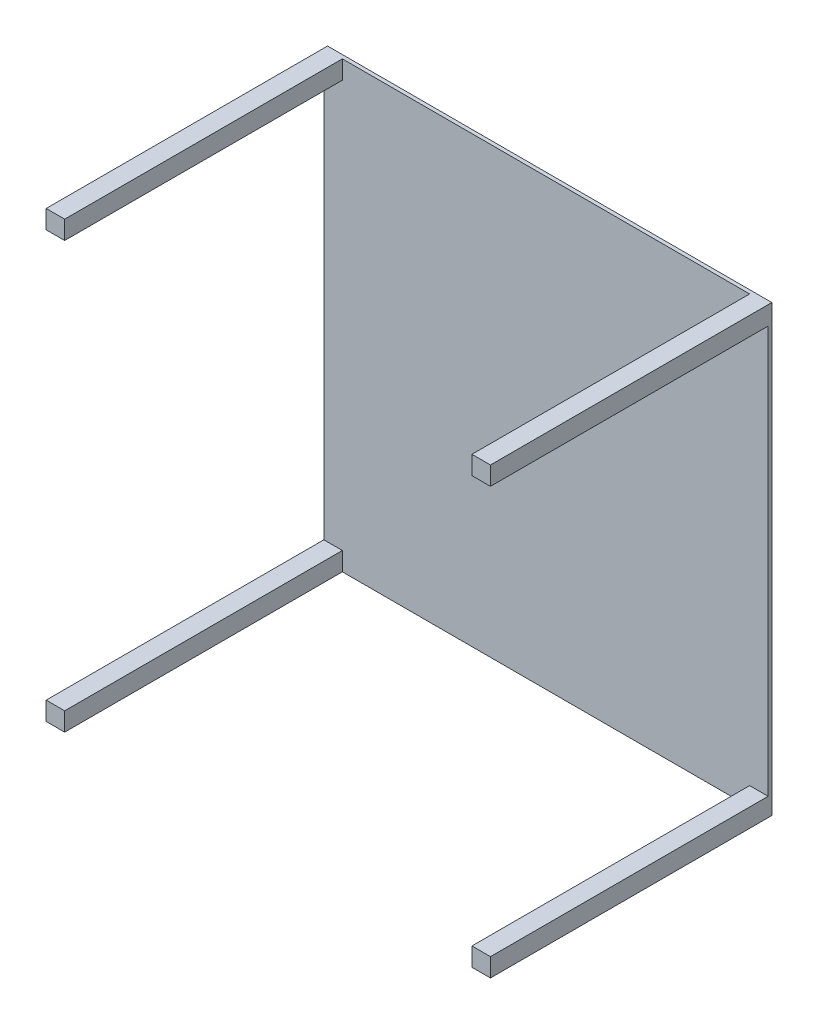
ISO-10303-21;
HEADER;
FILE_DESCRIPTION(('STEP AP214'),'2;1');
FILE_NAME('part.step','',(''),(''),'','','');
FILE_SCHEMA(('AUTOMOTIVE_DESIGN { 1 0 10303 214 1 1 1 1 }'));
ENDSEC;
DATA;
#1=APPLICATION_CONTEXT('core data for automotive mechanical design processes');
#2=APPLICATION_PROTOCOL_DEFINITION('international standard','automotive_design',2000,#1);
#3=PRODUCT_CONTEXT('',#1,'mechanical');
#4=PRODUCT('Part','Part','',(#3));
#5=PRODUCT_RELATED_PRODUCT_CATEGORY('part','',(#4));
#6=PRODUCT_DEFINITION_FORMATION('','',#4);
#7=PRODUCT_DEFINITION_CONTEXT('part definition',#1,'design');
#8=PRODUCT_DEFINITION('design','',#6,#7);
#9=PRODUCT_DEFINITION_SHAPE('','',#8);
#10=(LENGTH_UNIT() NAMED_UNIT(*) SI_UNIT(.MILLI.,.METRE.));
#11=(NAMED_UNIT(*) PLANE_ANGLE_UNIT() SI_UNIT($,.RADIAN.));
#12=(NAMED_UNIT(*) SI_UNIT($,.STERADIAN.) SOLID_ANGLE_UNIT());
#13=UNCERTAINTY_MEASURE_WITH_UNIT(LENGTH_MEASURE(1.E-05),#10,'distance_accuracy_value','');
#14=(GEOMETRIC_REPRESENTATION_CONTEXT(3) GLOBAL_UNCERTAINTY_ASSIGNED_CONTEXT((#13)) GLOBAL_UNIT_ASSIGNED_CONTEXT((#10,
#11,#12)) REPRESENTATION_CONTEXT('',''));
#15=CARTESIAN_POINT('',(0.,0.,0.));
#16=DIRECTION('',(0.,0.,1.));
#17=DIRECTION('',(1.,0.,0.));
#18=AXIS2_PLACEMENT_3D('',#15,#16,#17);
#19=CARTESIAN_POINT('',(0.,0.,10.));
#20=DIRECTION('',(0.,0.,-1.));
#21=DIRECTION('',(-1.,0.,0.));
#22=AXIS2_PLACEMENT_3D('',#19,#20,#21);
#23=PLANE('',#22);
#24=DIRECTION('',(0.,-1.,0.));
#25=VECTOR('',#24,1.);
#26=CARTESIAN_POINT('',(-50.,0.,10.));
#27=LINE('',#26,#25);
#28=CARTESIAN_POINT('',(-50.,0.,10.));
#29=VERTEX_POINT('',#28);
#30=CARTESIAN_POINT('',(-50.,-50.,10.));
#31=VERTEX_POINT('',#30);
#32=EDGE_CURVE('E169',#29,#31,#27,.T.);
#33=ORIENTED_EDGE('',*,*,#32,.F.);
#34=DIRECTION('',(-1.,0.,0.));
#35=VECTOR('',#34,1.);
#36=CARTESIAN_POINT('',(0.,0.,10.));
#37=LINE('',#36,#35);
#38=CARTESIAN_POINT('',(-1150.,-1.40834381901946E-13,10.));
#39=VERTEX_POINT('',#38);
#40=EDGE_CURVE('E36',#29,#39,#37,.T.);
#41=ORIENTED_EDGE('',*,*,#40,.T.);
#42=DIRECTION('',(0.,1.,0.));
#43=VECTOR('',#42,1.);
#44=CARTESIAN_POINT('',(-1150.,0.,10.));
#45=LINE('',#44,#43);
#46=CARTESIAN_POINT('',(-1150.,-50.,10.));
#47=VERTEX_POINT('',#46);
#48=EDGE_CURVE('E229',#47,#39,#45,.T.);
#49=ORIENTED_EDGE('',*,*,#48,.F.);
#50=DIRECTION('',(1.,0.,0.));
#51=VECTOR('',#50,1.);
#52=CARTESIAN_POINT('',(-1200.,-50.,10.));
#53=LINE('',#52,#51);
#54=CARTESIAN_POINT('',(-1200.,-50.,10.));
#55=VERTEX_POINT('',#54);
#56=EDGE_CURVE('E224',#55,#47,#53,.T.);
#57=ORIENTED_EDGE('',*,*,#56,.F.);
#58=DIRECTION('',(0.,-1.,0.));
#59=VECTOR('',#58,1.);
#60=CARTESIAN_POINT('',(-1200.,-1.46957615897682E-13,10.));
#61=LINE('',#60,#59);
#62=CARTESIAN_POINT('',(-1200.,-1150.,10.));
#63=VERTEX_POINT('',#62);
#64=EDGE_CURVE('E269',#55,#63,#61,.T.);
#65=ORIENTED_EDGE('',*,*,#64,.T.);
#66=DIRECTION('',(-1.,0.,0.));
#67=VECTOR('',#66,1.);
#68=CARTESIAN_POINT('',(-1200.,-1150.,10.));
#69=LINE('',#68,#67);
#70=CARTESIAN_POINT('',(-1150.,-1150.,10.));
#71=VERTEX_POINT('',#70);
#72=EDGE_CURVE('E205',#71,#63,#69,.T.);
#73=ORIENTED_EDGE('',*,*,#72,.F.);
#74=DIRECTION('',(0.,1.,0.));
#75=VECTOR('',#74,1.);
#76=CARTESIAN_POINT('',(-1150.,-1150.,10.));
#77=LINE('',#76,#75);
#78=CARTESIAN_POINT('',(-1150.,-1200.,10.));
#79=VERTEX_POINT('',#78);
#80=EDGE_CURVE('E200',#79,#71,#77,.T.);
#81=ORIENTED_EDGE('',*,*,#80,.F.);
#82=DIRECTION('',(1.,0.,0.));
#83=VECTOR('',#82,1.);
#84=CARTESIAN_POINT('',(1.46957615897682E-13,-1200.,10.));
#85=LINE('',#84,#83);
#86=CARTESIAN_POINT('',(-49.9999999999998,-1200.,10.));
#87=VERTEX_POINT('',#86);
#88=EDGE_CURVE('E271',#79,#87,#85,.T.);
#89=ORIENTED_EDGE('',*,*,#88,.T.);
#90=DIRECTION('',(0.,-1.,0.));
#91=VECTOR('',#90,1.);
#92=CARTESIAN_POINT('',(-49.9999999999998,-1150.,10.));
#93=LINE('',#92,#91);
#94=CARTESIAN_POINT('',(-49.9999999999998,-1150.,10.));
#95=VERTEX_POINT('',#94);
#96=EDGE_CURVE('E170',#95,#87,#93,.T.);
#97=ORIENTED_EDGE('',*,*,#96,.F.);
#98=DIRECTION('',(-1.,0.,0.));
#99=VECTOR('',#98,1.);
#100=CARTESIAN_POINT('',(-49.9999999999998,-1150.,10.));
#101=LINE('',#100,#99);
#102=CARTESIAN_POINT('',(1.40834381901946E-13,-1150.,10.));
#103=VERTEX_POINT('',#102);
#104=EDGE_CURVE('E173',#103,#95,#101,.T.);
#105=ORIENTED_EDGE('',*,*,#104,.F.);
#106=DIRECTION('',(0.,1.,0.));
#107=VECTOR('',#106,1.);
#108=CARTESIAN_POINT('',(0.,0.,10.));
#109=LINE('',#108,#107);
#110=CARTESIAN_POINT('',(0.,-50.,10.));
#111=VERTEX_POINT('',#110);
#112=EDGE_CURVE('E55',#103,#111,#109,.T.);
#113=ORIENTED_EDGE('',*,*,#112,.T.);
#114=DIRECTION('',(1.,0.,0.));
#115=VECTOR('',#114,1.);
#116=CARTESIAN_POINT('',(-50.,-50.,10.));
#117=LINE('',#116,#115);
#118=EDGE_CURVE('E50',#31,#111,#117,.T.);
#119=ORIENTED_EDGE('',*,*,#118,.F.);
#120=EDGE_LOOP('',(#33,#41,#49,#57,#65,#73,#81,#89,#97,#105,#113,#119));
#121=FACE_BOUND('',#120,.T.);
#122=ADVANCED_FACE('F32',(#121),#23,.F.);
#123=CARTESIAN_POINT('',(0.,0.,10.));
#124=DIRECTION('',(-1.,0.,0.));
#125=DIRECTION('',(0.,-1.,0.));
#126=AXIS2_PLACEMENT_3D('',#123,#124,#125);
#127=PLANE('',#126);
#128=DIRECTION('',(0.,1.,0.));
#129=VECTOR('',#128,1.);
#130=CARTESIAN_POINT('',(0.,0.,0.));
#131=LINE('',#130,#129);
#132=CARTESIAN_POINT('',(1.46957615897682E-13,-1200.,0.));
#133=VERTEX_POINT('',#132);
#134=CARTESIAN_POINT('',(0.,0.,0.));
#135=VERTEX_POINT('',#134);
#136=EDGE_CURVE('E258',#133,#135,#131,.T.);
#137=ORIENTED_EDGE('',*,*,#136,.T.);
#138=DIRECTION('',(0.,0.,-1.));
#139=VECTOR('',#138,1.);
#140=CARTESIAN_POINT('',(0.,0.,10.));
#141=LINE('',#140,#139);
#142=CARTESIAN_POINT('',(0.,0.,760.));
#143=VERTEX_POINT('',#142);
#144=EDGE_CURVE('E11',#143,#135,#141,.T.);
#145=ORIENTED_EDGE('',*,*,#144,.F.);
#146=DIRECTION('',(0.,1.,0.));
#147=VECTOR('',#146,1.);
#148=CARTESIAN_POINT('',(0.,0.,760.));
#149=LINE('',#148,#147);
#150=CARTESIAN_POINT('',(0.,-50.,760.));
#151=VERTEX_POINT('',#150);
#152=EDGE_CURVE('E157',#151,#143,#149,.T.);
#153=ORIENTED_EDGE('',*,*,#152,.F.);
#154=DIRECTION('',(0.,0.,-1.));
#155=VECTOR('',#154,1.);
#156=CARTESIAN_POINT('',(0.,-50.,760.));
#157=LINE('',#156,#155);
#158=EDGE_CURVE('E153',#151,#111,#157,.T.);
#159=ORIENTED_EDGE('',*,*,#158,.T.);
#160=ORIENTED_EDGE('',*,*,#112,.F.);
#161=DIRECTION('',(0.,0.,-1.));
#162=VECTOR('',#161,1.);
#163=CARTESIAN_POINT('',(2.08166817117217E-13,-1150.,760.));
#164=LINE('',#163,#162);
#165=CARTESIAN_POINT('',(2.08166817117217E-13,-1150.,760.));
#166=VERTEX_POINT('',#165);
#167=EDGE_CURVE('E194',#166,#103,#164,.T.);
#168=ORIENTED_EDGE('',*,*,#167,.F.);
#169=DIRECTION('',(0.,1.,0.));
#170=VECTOR('',#169,1.);
#171=CARTESIAN_POINT('',(2.08166817117217E-13,-1150.,760.));
#172=LINE('',#171,#170);
#173=CARTESIAN_POINT('',(2.22044604925031E-13,-1200.,760.));
#174=VERTEX_POINT('',#173);
#175=EDGE_CURVE('E185',#174,#166,#172,.T.);
#176=ORIENTED_EDGE('',*,*,#175,.F.);
#177=DIRECTION('',(0.,0.,-1.));
#178=VECTOR('',#177,1.);
#179=CARTESIAN_POINT('',(1.46957615897682E-13,-1200.,10.));
#180=LINE('',#179,#178);
#181=EDGE_CURVE('E276',#174,#133,#180,.T.);
#182=ORIENTED_EDGE('',*,*,#181,.T.);
#183=EDGE_LOOP('',(#137,#145,#153,#159,#160,#168,#176,#182));
#184=FACE_BOUND('',#183,.T.);
#185=ADVANCED_FACE('F34',(#184),#127,.F.);
#186=CARTESIAN_POINT('',(0.,0.,10.));
#187=DIRECTION('',(0.,-1.,0.));
#188=DIRECTION('',(1.,0.,0.));
#189=AXIS2_PLACEMENT_3D('',#186,#187,#188);
#190=PLANE('',#189);
#191=DIRECTION('',(-1.,0.,0.));
#192=VECTOR('',#191,1.);
#193=CARTESIAN_POINT('',(0.,0.,0.));
#194=LINE('',#193,#192);
#195=CARTESIAN_POINT('',(-1200.,-1.46957615897682E-13,0.));
#196=VERTEX_POINT('',#195);
#197=EDGE_CURVE('E263',#135,#196,#194,.T.);
#198=ORIENTED_EDGE('',*,*,#197,.T.);
#199=DIRECTION('',(0.,0.,-1.));
#200=VECTOR('',#199,1.);
#201=CARTESIAN_POINT('',(-1200.,-1.46957615897682E-13,10.));
#202=LINE('',#201,#200);
#203=CARTESIAN_POINT('',(-1200.,-1.46957615897682E-13,760.));
#204=VERTEX_POINT('',#203);
#205=EDGE_CURVE('E42',#204,#196,#202,.T.);
#206=ORIENTED_EDGE('',*,*,#205,.F.);
#207=DIRECTION('',(-1.,0.,0.));
#208=VECTOR('',#207,1.);
#209=CARTESIAN_POINT('',(-1200.,-1.46957615897682E-13,760.));
#210=LINE('',#209,#208);
#211=CARTESIAN_POINT('',(-1150.,0.,760.));
#212=VERTEX_POINT('',#211);
#213=EDGE_CURVE('E233',#212,#204,#210,.T.);
#214=ORIENTED_EDGE('',*,*,#213,.F.);
#215=DIRECTION('',(0.,0.,-1.));
#216=VECTOR('',#215,1.);
#217=CARTESIAN_POINT('',(-1150.,0.,760.));
#218=LINE('',#217,#216);
#219=EDGE_CURVE('E236',#212,#39,#218,.T.);
#220=ORIENTED_EDGE('',*,*,#219,.T.);
#221=ORIENTED_EDGE('',*,*,#40,.F.);
#222=DIRECTION('',(0.,0.,-1.));
#223=VECTOR('',#222,1.);
#224=CARTESIAN_POINT('',(-50.,0.,760.));
#225=LINE('',#224,#223);
#226=CARTESIAN_POINT('',(-50.,0.,760.));
#227=VERTEX_POINT('',#226);
#228=EDGE_CURVE('E175',#227,#29,#225,.T.);
#229=ORIENTED_EDGE('',*,*,#228,.F.);
#230=DIRECTION('',(-1.,0.,0.));
#231=VECTOR('',#230,1.);
#232=CARTESIAN_POINT('',(-50.,0.,760.));
#233=LINE('',#232,#231);
#234=EDGE_CURVE('E163',#143,#227,#233,.T.);
#235=ORIENTED_EDGE('',*,*,#234,.F.);
#236=ORIENTED_EDGE('',*,*,#144,.T.);
#237=EDGE_LOOP('',(#198,#206,#214,#220,#221,#229,#235,#236));
#238=FACE_BOUND('',#237,.T.);
#239=ADVANCED_FACE('F328',(#238),#190,.F.);
#240=CARTESIAN_POINT('',(-1200.,-1.46957615897682E-13,10.));
#241=DIRECTION('',(1.,0.,0.));
#242=DIRECTION('',(0.,1.,0.));
#243=AXIS2_PLACEMENT_3D('',#240,#241,#242);
#244=PLANE('',#243);
#245=DIRECTION('',(0.,-1.,0.));
#246=VECTOR('',#245,1.);
#247=CARTESIAN_POINT('',(-1200.,-1.46957615897682E-13,0.));
#248=LINE('',#247,#246);
#249=CARTESIAN_POINT('',(-1200.,-1200.,0.));
#250=VERTEX_POINT('',#249);
#251=EDGE_CURVE('E279',#196,#250,#248,.T.);
#252=ORIENTED_EDGE('',*,*,#251,.T.);
#253=DIRECTION('',(0.,0.,-1.));
#254=VECTOR('',#253,1.);
#255=CARTESIAN_POINT('',(-1200.,-1200.,10.));
#256=LINE('',#255,#254);
#257=CARTESIAN_POINT('',(-1200.,-1200.,760.));
#258=VERTEX_POINT('',#257);
#259=EDGE_CURVE('E285',#258,#250,#256,.T.);
#260=ORIENTED_EDGE('',*,*,#259,.F.);
#261=DIRECTION('',(0.,-1.,0.));
#262=VECTOR('',#261,1.);
#263=CARTESIAN_POINT('',(-1200.,-1150.,760.));
#264=LINE('',#263,#262);
#265=CARTESIAN_POINT('',(-1200.,-1150.,760.));
#266=VERTEX_POINT('',#265);
#267=EDGE_CURVE('E201',#266,#258,#264,.T.);
#268=ORIENTED_EDGE('',*,*,#267,.F.);
#269=DIRECTION('',(0.,0.,-1.));
#270=VECTOR('',#269,1.);
#271=CARTESIAN_POINT('',(-1200.,-1150.,760.));
#272=LINE('',#271,#270);
#273=EDGE_CURVE('E211',#266,#63,#272,.T.);
#274=ORIENTED_EDGE('',*,*,#273,.T.);
#275=ORIENTED_EDGE('',*,*,#64,.F.);
#276=DIRECTION('',(0.,0.,-1.));
#277=VECTOR('',#276,1.);
#278=CARTESIAN_POINT('',(-1200.,-50.,760.));
#279=LINE('',#278,#277);
#280=CARTESIAN_POINT('',(-1200.,-50.,760.));
#281=VERTEX_POINT('',#280);
#282=EDGE_CURVE('E253',#281,#55,#279,.T.);
#283=ORIENTED_EDGE('',*,*,#282,.F.);
#284=DIRECTION('',(0.,-1.,0.));
#285=VECTOR('',#284,1.);
#286=CARTESIAN_POINT('',(-1200.,-1.46957615897682E-13,760.));
#287=LINE('',#286,#285);
#288=EDGE_CURVE('E225',#204,#281,#287,.T.);
#289=ORIENTED_EDGE('',*,*,#288,.F.);
#290=ORIENTED_EDGE('',*,*,#205,.T.);
#291=EDGE_LOOP('',(#252,#260,#268,#274,#275,#283,#289,#290));
#292=FACE_BOUND('',#291,.T.);
#293=ADVANCED_FACE('F291',(#292),#244,.F.);
#294=CARTESIAN_POINT('',(1.46957615897682E-13,-1200.,10.));
#295=DIRECTION('',(0.,1.,0.));
#296=DIRECTION('',(-1.,0.,0.));
#297=AXIS2_PLACEMENT_3D('',#294,#295,#296);
#298=PLANE('',#297);
#299=DIRECTION('',(1.,0.,0.));
#300=VECTOR('',#299,1.);
#301=CARTESIAN_POINT('',(1.46957615897682E-13,-1200.,0.));
#302=LINE('',#301,#300);
#303=EDGE_CURVE('E281',#250,#133,#302,.T.);
#304=ORIENTED_EDGE('',*,*,#303,.T.);
#305=ORIENTED_EDGE('',*,*,#181,.F.);
#306=DIRECTION('',(1.,0.,0.));
#307=VECTOR('',#306,1.);
#308=CARTESIAN_POINT('',(-49.9999999999998,-1200.,760.));
#309=LINE('',#308,#307);
#310=CARTESIAN_POINT('',(-49.9999999999998,-1200.,760.));
#311=VERTEX_POINT('',#310);
#312=EDGE_CURVE('E182',#311,#174,#309,.T.);
#313=ORIENTED_EDGE('',*,*,#312,.F.);
#314=DIRECTION('',(0.,0.,-1.));
#315=VECTOR('',#314,1.);
#316=CARTESIAN_POINT('',(-49.9999999999998,-1200.,760.));
#317=LINE('',#316,#315);
#318=EDGE_CURVE('E197',#311,#87,#317,.T.);
#319=ORIENTED_EDGE('',*,*,#318,.T.);
#320=ORIENTED_EDGE('',*,*,#88,.F.);
#321=DIRECTION('',(0.,0.,-1.));
#322=VECTOR('',#321,1.);
#323=CARTESIAN_POINT('',(-1150.,-1200.,760.));
#324=LINE('',#323,#322);
#325=CARTESIAN_POINT('',(-1150.,-1200.,760.));
#326=VERTEX_POINT('',#325);
#327=EDGE_CURVE('E221',#326,#79,#324,.T.);
#328=ORIENTED_EDGE('',*,*,#327,.F.);
#329=DIRECTION('',(1.,0.,0.));
#330=VECTOR('',#329,1.);
#331=CARTESIAN_POINT('',(-1200.,-1200.,760.));
#332=LINE('',#331,#330);
#333=EDGE_CURVE('E204',#258,#326,#332,.T.);
#334=ORIENTED_EDGE('',*,*,#333,.F.);
#335=ORIENTED_EDGE('',*,*,#259,.T.);
#336=EDGE_LOOP('',(#304,#305,#313,#319,#320,#328,#334,#335));
#337=FACE_BOUND('',#336,.T.);
#338=ADVANCED_FACE('F297',(#337),#298,.F.);
#339=CARTESIAN_POINT('',(0.,0.,0.));
#340=DIRECTION('',(0.,0.,-1.));
#341=DIRECTION('',(-1.,0.,0.));
#342=AXIS2_PLACEMENT_3D('',#339,#340,#341);
#343=PLANE('',#342);
#344=ORIENTED_EDGE('',*,*,#136,.F.);
#345=ORIENTED_EDGE('',*,*,#303,.F.);
#346=ORIENTED_EDGE('',*,*,#251,.F.);
#347=ORIENTED_EDGE('',*,*,#197,.F.);
#348=EDGE_LOOP('',(#344,#345,#346,#347));
#349=FACE_BOUND('',#348,.T.);
#350=ADVANCED_FACE('F295',(#349),#343,.T.);
#351=CARTESIAN_POINT('',(-1200.,-50.,760.));
#352=DIRECTION('',(0.,1.,0.));
#353=DIRECTION('',(0.,0.,1.));
#354=AXIS2_PLACEMENT_3D('',#351,#352,#353);
#355=PLANE('',#354);
#356=ORIENTED_EDGE('',*,*,#56,.T.);
#357=DIRECTION('',(0.,0.,-1.));
#358=VECTOR('',#357,1.);
#359=CARTESIAN_POINT('',(-1150.,-50.,760.));
#360=LINE('',#359,#358);
#361=CARTESIAN_POINT('',(-1150.,-50.,760.));
#362=VERTEX_POINT('',#361);
#363=EDGE_CURVE('E239',#362,#47,#360,.T.);
#364=ORIENTED_EDGE('',*,*,#363,.F.);
#365=DIRECTION('',(1.,0.,0.));
#366=VECTOR('',#365,1.);
#367=CARTESIAN_POINT('',(-1200.,-50.,760.));
#368=LINE('',#367,#366);
#369=EDGE_CURVE('E228',#281,#362,#368,.T.);
#370=ORIENTED_EDGE('',*,*,#369,.F.);
#371=ORIENTED_EDGE('',*,*,#282,.T.);
#372=EDGE_LOOP('',(#356,#364,#370,#371));
#373=FACE_BOUND('',#372,.T.);
#374=ADVANCED_FACE('F331',(#373),#355,.F.);
#375=CARTESIAN_POINT('',(-1150.,0.,760.));
#376=DIRECTION('',(-1.,0.,0.));
#377=DIRECTION('',(0.,0.,1.));
#378=AXIS2_PLACEMENT_3D('',#375,#376,#377);
#379=PLANE('',#378);
#380=ORIENTED_EDGE('',*,*,#48,.T.);
#381=ORIENTED_EDGE('',*,*,#219,.F.);
#382=DIRECTION('',(0.,1.,0.));
#383=VECTOR('',#382,1.);
#384=CARTESIAN_POINT('',(-1150.,0.,760.));
#385=LINE('',#384,#383);
#386=EDGE_CURVE('E231',#362,#212,#385,.T.);
#387=ORIENTED_EDGE('',*,*,#386,.F.);
#388=ORIENTED_EDGE('',*,*,#363,.T.);
#389=EDGE_LOOP('',(#380,#381,#387,#388));
#390=FACE_BOUND('',#389,.T.);
#391=ADVANCED_FACE('F345',(#390),#379,.F.);
#392=CARTESIAN_POINT('',(0.,0.,760.));
#393=DIRECTION('',(0.,0.,1.));
#394=DIRECTION('',(1.,0.,0.));
#395=AXIS2_PLACEMENT_3D('',#392,#393,#394);
#396=PLANE('',#395);
#397=ORIENTED_EDGE('',*,*,#288,.T.);
#398=ORIENTED_EDGE('',*,*,#369,.T.);
#399=ORIENTED_EDGE('',*,*,#386,.T.);
#400=ORIENTED_EDGE('',*,*,#213,.T.);
#401=EDGE_LOOP('',(#397,#398,#399,#400));
#402=FACE_BOUND('',#401,.T.);
#403=ADVANCED_FACE('F347',(#402),#396,.T.);
#404=CARTESIAN_POINT('',(-1150.,-1150.,760.));
#405=DIRECTION('',(-1.,0.,0.));
#406=DIRECTION('',(0.,0.,1.));
#407=AXIS2_PLACEMENT_3D('',#404,#405,#406);
#408=PLANE('',#407);
#409=ORIENTED_EDGE('',*,*,#80,.T.);
#410=DIRECTION('',(0.,0.,-1.));
#411=VECTOR('',#410,1.);
#412=CARTESIAN_POINT('',(-1150.,-1150.,760.));
#413=LINE('',#412,#411);
#414=CARTESIAN_POINT('',(-1150.,-1150.,760.));
#415=VERTEX_POINT('',#414);
#416=EDGE_CURVE('E218',#415,#71,#413,.T.);
#417=ORIENTED_EDGE('',*,*,#416,.F.);
#418=DIRECTION('',(0.,1.,0.));
#419=VECTOR('',#418,1.);
#420=CARTESIAN_POINT('',(-1150.,-1150.,760.));
#421=LINE('',#420,#419);
#422=EDGE_CURVE('E207',#326,#415,#421,.T.);
#423=ORIENTED_EDGE('',*,*,#422,.F.);
#424=ORIENTED_EDGE('',*,*,#327,.T.);
#425=EDGE_LOOP('',(#409,#417,#423,#424));
#426=FACE_BOUND('',#425,.T.);
#427=ADVANCED_FACE('F356',(#426),#408,.F.);
#428=CARTESIAN_POINT('',(-1200.,-1150.,760.));
#429=DIRECTION('',(0.,-1.,0.));
#430=DIRECTION('',(0.,0.,-1.));
#431=AXIS2_PLACEMENT_3D('',#428,#429,#430);
#432=PLANE('',#431);
#433=ORIENTED_EDGE('',*,*,#72,.T.);
#434=ORIENTED_EDGE('',*,*,#273,.F.);
#435=DIRECTION('',(-1.,0.,0.));
#436=VECTOR('',#435,1.);
#437=CARTESIAN_POINT('',(-1200.,-1150.,760.));
#438=LINE('',#437,#436);
#439=EDGE_CURVE('E209',#415,#266,#438,.T.);
#440=ORIENTED_EDGE('',*,*,#439,.F.);
#441=ORIENTED_EDGE('',*,*,#416,.T.);
#442=EDGE_LOOP('',(#433,#434,#440,#441));
#443=FACE_BOUND('',#442,.T.);
#444=ADVANCED_FACE('F353',(#443),#432,.F.);
#445=CARTESIAN_POINT('',(0.,0.,760.));
#446=DIRECTION('',(0.,0.,1.));
#447=DIRECTION('',(1.,0.,0.));
#448=AXIS2_PLACEMENT_3D('',#445,#446,#447);
#449=PLANE('',#448);
#450=ORIENTED_EDGE('',*,*,#267,.T.);
#451=ORIENTED_EDGE('',*,*,#333,.T.);
#452=ORIENTED_EDGE('',*,*,#422,.T.);
#453=ORIENTED_EDGE('',*,*,#439,.T.);
#454=EDGE_LOOP('',(#450,#451,#452,#453));
#455=FACE_BOUND('',#454,.T.);
#456=ADVANCED_FACE('F321',(#455),#449,.T.);
#457=CARTESIAN_POINT('',(-49.9999999999998,-1150.,760.));
#458=DIRECTION('',(1.,0.,0.));
#459=DIRECTION('',(0.,1.,0.));
#460=AXIS2_PLACEMENT_3D('',#457,#458,#459);
#461=PLANE('',#460);
#462=ORIENTED_EDGE('',*,*,#96,.T.);
#463=ORIENTED_EDGE('',*,*,#318,.F.);
#464=DIRECTION('',(0.,-1.,0.));
#465=VECTOR('',#464,1.);
#466=CARTESIAN_POINT('',(-49.9999999999998,-1150.,760.));
#467=LINE('',#466,#465);
#468=CARTESIAN_POINT('',(-49.9999999999998,-1150.,760.));
#469=VERTEX_POINT('',#468);
#470=EDGE_CURVE('E179',#469,#311,#467,.T.);
#471=ORIENTED_EDGE('',*,*,#470,.F.);
#472=DIRECTION('',(0.,0.,-1.));
#473=VECTOR('',#472,1.);
#474=CARTESIAN_POINT('',(-49.9999999999998,-1150.,760.));
#475=LINE('',#474,#473);
#476=EDGE_CURVE('E188',#469,#95,#475,.T.);
#477=ORIENTED_EDGE('',*,*,#476,.T.);
#478=EDGE_LOOP('',(#462,#463,#471,#477));
#479=FACE_BOUND('',#478,.T.);
#480=ADVANCED_FACE('F311',(#479),#461,.F.);
#481=CARTESIAN_POINT('',(-49.9999999999998,-1150.,760.));
#482=DIRECTION('',(0.,-1.,0.));
#483=DIRECTION('',(0.,0.,-1.));
#484=AXIS2_PLACEMENT_3D('',#481,#482,#483);
#485=PLANE('',#484);
#486=ORIENTED_EDGE('',*,*,#104,.T.);
#487=ORIENTED_EDGE('',*,*,#476,.F.);
#488=DIRECTION('',(-1.,0.,0.));
#489=VECTOR('',#488,1.);
#490=CARTESIAN_POINT('',(-49.9999999999998,-1150.,760.));
#491=LINE('',#490,#489);
#492=EDGE_CURVE('E187',#166,#469,#491,.T.);
#493=ORIENTED_EDGE('',*,*,#492,.F.);
#494=ORIENTED_EDGE('',*,*,#167,.T.);
#495=EDGE_LOOP('',(#486,#487,#493,#494));
#496=FACE_BOUND('',#495,.T.);
#497=ADVANCED_FACE('F313',(#496),#485,.F.);
#498=CARTESIAN_POINT('',(0.,0.,760.));
#499=DIRECTION('',(0.,0.,1.));
#500=DIRECTION('',(1.,0.,0.));
#501=AXIS2_PLACEMENT_3D('',#498,#499,#500);
#502=PLANE('',#501);
#503=ORIENTED_EDGE('',*,*,#470,.T.);
#504=ORIENTED_EDGE('',*,*,#312,.T.);
#505=ORIENTED_EDGE('',*,*,#175,.T.);
#506=ORIENTED_EDGE('',*,*,#492,.T.);
#507=EDGE_LOOP('',(#503,#504,#505,#506));
#508=FACE_BOUND('',#507,.T.);
#509=ADVANCED_FACE('F304',(#508),#502,.T.);
#510=CARTESIAN_POINT('',(-50.,0.,760.));
#511=DIRECTION('',(1.,0.,0.));
#512=DIRECTION('',(0.,1.,0.));
#513=AXIS2_PLACEMENT_3D('',#510,#511,#512);
#514=PLANE('',#513);
#515=ORIENTED_EDGE('',*,*,#32,.T.);
#516=DIRECTION('',(0.,0.,-1.));
#517=VECTOR('',#516,1.);
#518=CARTESIAN_POINT('',(-50.,-50.,760.));
#519=LINE('',#518,#517);
#520=CARTESIAN_POINT('',(-50.,-50.,760.));
#521=VERTEX_POINT('',#520);
#522=EDGE_CURVE('E150',#521,#31,#519,.T.);
#523=ORIENTED_EDGE('',*,*,#522,.F.);
#524=DIRECTION('',(0.,-1.,0.));
#525=VECTOR('',#524,1.);
#526=CARTESIAN_POINT('',(-50.,0.,760.));
#527=LINE('',#526,#525);
#528=EDGE_CURVE('E158',#227,#521,#527,.T.);
#529=ORIENTED_EDGE('',*,*,#528,.F.);
#530=ORIENTED_EDGE('',*,*,#228,.T.);
#531=EDGE_LOOP('',(#515,#523,#529,#530));
#532=FACE_BOUND('',#531,.T.);
#533=ADVANCED_FACE('F168',(#532),#514,.F.);
#534=CARTESIAN_POINT('',(-50.,-50.,760.));
#535=DIRECTION('',(0.,1.,0.));
#536=DIRECTION('',(0.,0.,1.));
#537=AXIS2_PLACEMENT_3D('',#534,#535,#536);
#538=PLANE('',#537);
#539=ORIENTED_EDGE('',*,*,#118,.T.);
#540=ORIENTED_EDGE('',*,*,#158,.F.);
#541=DIRECTION('',(1.,0.,0.));
#542=VECTOR('',#541,1.);
#543=CARTESIAN_POINT('',(-50.,-50.,760.));
#544=LINE('',#543,#542);
#545=EDGE_CURVE('E146',#521,#151,#544,.T.);
#546=ORIENTED_EDGE('',*,*,#545,.F.);
#547=ORIENTED_EDGE('',*,*,#522,.T.);
#548=EDGE_LOOP('',(#539,#540,#546,#547));
#549=FACE_BOUND('',#548,.T.);
#550=ADVANCED_FACE('F148',(#549),#538,.F.);
#551=CARTESIAN_POINT('',(0.,0.,760.));
#552=DIRECTION('',(0.,0.,1.));
#553=DIRECTION('',(1.,0.,0.));
#554=AXIS2_PLACEMENT_3D('',#551,#552,#553);
#555=PLANE('',#554);
#556=ORIENTED_EDGE('',*,*,#528,.T.);
#557=ORIENTED_EDGE('',*,*,#545,.T.);
#558=ORIENTED_EDGE('',*,*,#152,.T.);
#559=ORIENTED_EDGE('',*,*,#234,.T.);
#560=EDGE_LOOP('',(#556,#557,#558,#559));
#561=FACE_BOUND('',#560,.T.);
#562=ADVANCED_FACE('F161',(#561),#555,.T.);
#563=CLOSED_SHELL('',(#122,#185,#239,#293,#338,#350,#374,#391,#403,#427,#444,#456,#480,#497,
#509,#533,#550,#562));
#564=MANIFOLD_SOLID_BREP('B2',#563);
#565=ADVANCED_BREP_SHAPE_REPRESENTATION('',(#18,#564),#14);
#566=SHAPE_DEFINITION_REPRESENTATION(#9,#565);
ENDSEC;
END-ISO-10303-21;
